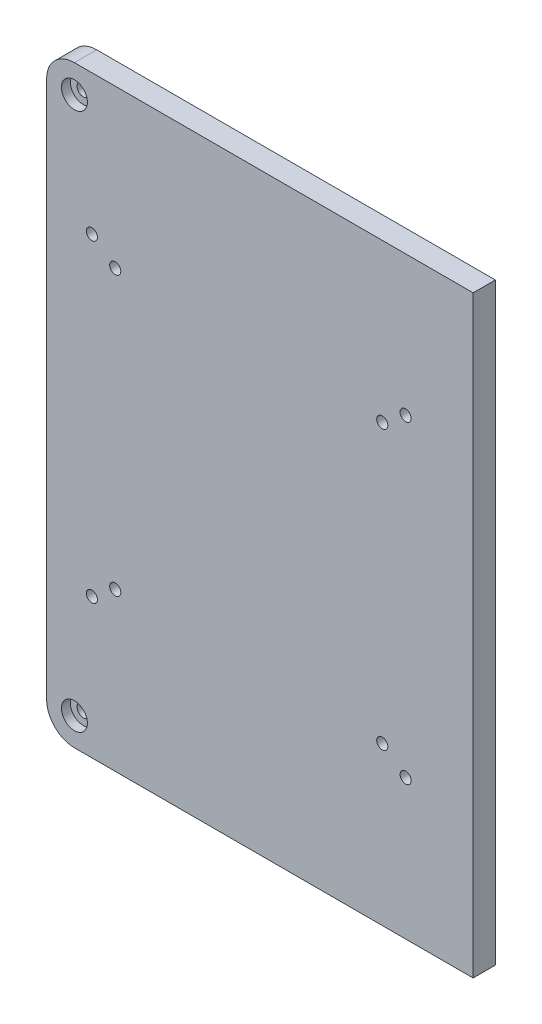
ISO-10303-21;
HEADER;
FILE_DESCRIPTION(('STEP AP214'),'2;1');
FILE_NAME('part.step','',(''),(''),'','','');
FILE_SCHEMA(('AUTOMOTIVE_DESIGN { 1 0 10303 214 1 1 1 1 }'));
ENDSEC;
DATA;
#1=APPLICATION_CONTEXT('core data for automotive mechanical design processes');
#2=APPLICATION_PROTOCOL_DEFINITION('international standard','automotive_design',2000,#1);
#3=PRODUCT_CONTEXT('',#1,'mechanical');
#4=PRODUCT('Part','Part','',(#3));
#5=PRODUCT_RELATED_PRODUCT_CATEGORY('part','',(#4));
#6=PRODUCT_DEFINITION_FORMATION('','',#4);
#7=PRODUCT_DEFINITION_CONTEXT('part definition',#1,'design');
#8=PRODUCT_DEFINITION('design','',#6,#7);
#9=PRODUCT_DEFINITION_SHAPE('','',#8);
#10=(LENGTH_UNIT() NAMED_UNIT(*) SI_UNIT(.MILLI.,.METRE.));
#11=(NAMED_UNIT(*) PLANE_ANGLE_UNIT() SI_UNIT($,.RADIAN.));
#12=(NAMED_UNIT(*) SI_UNIT($,.STERADIAN.) SOLID_ANGLE_UNIT());
#13=UNCERTAINTY_MEASURE_WITH_UNIT(LENGTH_MEASURE(1.E-05),#10,'distance_accuracy_value','');
#14=(GEOMETRIC_REPRESENTATION_CONTEXT(3) GLOBAL_UNCERTAINTY_ASSIGNED_CONTEXT((#13)) GLOBAL_UNIT_ASSIGNED_CONTEXT((#10,
#11,#12)) REPRESENTATION_CONTEXT('',''));
#15=CARTESIAN_POINT('',(0.,0.,0.));
#16=DIRECTION('',(0.,0.,1.));
#17=DIRECTION('',(1.,0.,0.));
#18=AXIS2_PLACEMENT_3D('',#15,#16,#17);
#19=CARTESIAN_POINT('',(-102.8,42.3,0.));
#20=DIRECTION('',(0.,0.,1.));
#21=DIRECTION('',(1.,0.,0.));
#22=AXIS2_PLACEMENT_3D('',#19,#20,#21);
#23=CYLINDRICAL_SURFACE('',#22,1.5);
#24=CARTESIAN_POINT('',(-102.8,42.3,6.));
#25=DIRECTION('',(0.,0.,1.));
#26=DIRECTION('',(1.,0.,0.));
#27=AXIS2_PLACEMENT_3D('',#24,#25,#26);
#28=CIRCLE('',#27,1.5);
#29=CARTESIAN_POINT('',(-101.3,42.3,6.));
#30=VERTEX_POINT('',#29);
#31=EDGE_CURVE('E154',#30,#30,#28,.T.);
#32=ORIENTED_EDGE('',*,*,#31,.T.);
#33=EDGE_LOOP('',(#32));
#34=FACE_BOUND('',#33,.T.);
#35=CARTESIAN_POINT('',(-102.8,42.3,3.5));
#36=DIRECTION('',(0.,0.,-1.));
#37=DIRECTION('',(-1.,0.,0.));
#38=AXIS2_PLACEMENT_3D('',#35,#36,#37);
#39=CIRCLE('',#38,1.5);
#40=CARTESIAN_POINT('',(-104.3,42.3,3.5));
#41=VERTEX_POINT('',#40);
#42=EDGE_CURVE('E36',#41,#41,#39,.F.);
#43=ORIENTED_EDGE('',*,*,#42,.F.);
#44=EDGE_LOOP('',(#43));
#45=FACE_BOUND('',#44,.T.);
#46=ADVANCED_FACE('F32',(#34,#45),#23,.F.);
#47=CARTESIAN_POINT('',(-18.2,-42.3,0.));
#48=DIRECTION('',(0.,0.,1.));
#49=DIRECTION('',(1.,0.,0.));
#50=AXIS2_PLACEMENT_3D('',#47,#48,#49);
#51=CYLINDRICAL_SURFACE('',#50,1.5);
#52=CARTESIAN_POINT('',(-18.2,-42.3,6.));
#53=DIRECTION('',(0.,0.,1.));
#54=DIRECTION('',(1.,0.,0.));
#55=AXIS2_PLACEMENT_3D('',#52,#53,#54);
#56=CIRCLE('',#55,1.5);
#57=CARTESIAN_POINT('',(-16.7,-42.3,6.));
#58=VERTEX_POINT('',#57);
#59=EDGE_CURVE('E155',#58,#58,#56,.T.);
#60=ORIENTED_EDGE('',*,*,#59,.T.);
#61=EDGE_LOOP('',(#60));
#62=FACE_BOUND('',#61,.T.);
#63=CARTESIAN_POINT('',(-18.2,-42.3,3.5));
#64=DIRECTION('',(0.,0.,-1.));
#65=DIRECTION('',(-1.,0.,0.));
#66=AXIS2_PLACEMENT_3D('',#63,#64,#65);
#67=CIRCLE('',#66,1.5);
#68=CARTESIAN_POINT('',(-19.7,-42.3,3.5));
#69=VERTEX_POINT('',#68);
#70=EDGE_CURVE('E134',#69,#69,#67,.F.);
#71=ORIENTED_EDGE('',*,*,#70,.F.);
#72=EDGE_LOOP('',(#71));
#73=FACE_BOUND('',#72,.T.);
#74=ADVANCED_FACE('F207',(#62,#73),#51,.F.);
#75=CARTESIAN_POINT('',(-102.8,-42.3,0.));
#76=DIRECTION('',(0.,0.,1.));
#77=DIRECTION('',(1.,0.,0.));
#78=AXIS2_PLACEMENT_3D('',#75,#76,#77);
#79=CYLINDRICAL_SURFACE('',#78,1.5);
#80=CARTESIAN_POINT('',(-102.8,-42.3,6.));
#81=DIRECTION('',(0.,0.,1.));
#82=DIRECTION('',(1.,0.,0.));
#83=AXIS2_PLACEMENT_3D('',#80,#81,#82);
#84=CIRCLE('',#83,1.5);
#85=CARTESIAN_POINT('',(-101.3,-42.3,6.));
#86=VERTEX_POINT('',#85);
#87=EDGE_CURVE('E151',#86,#86,#84,.T.);
#88=ORIENTED_EDGE('',*,*,#87,.T.);
#89=EDGE_LOOP('',(#88));
#90=FACE_BOUND('',#89,.T.);
#91=CARTESIAN_POINT('',(-102.8,-42.3,3.5));
#92=DIRECTION('',(0.,0.,-1.));
#93=DIRECTION('',(-1.,0.,0.));
#94=AXIS2_PLACEMENT_3D('',#91,#92,#93);
#95=CIRCLE('',#94,1.5);
#96=CARTESIAN_POINT('',(-104.3,-42.3,3.5));
#97=VERTEX_POINT('',#96);
#98=EDGE_CURVE('E132',#97,#97,#95,.F.);
#99=ORIENTED_EDGE('',*,*,#98,.F.);
#100=EDGE_LOOP('',(#99));
#101=FACE_BOUND('',#100,.T.);
#102=ADVANCED_FACE('F213',(#90,#101),#79,.F.);
#103=CARTESIAN_POINT('',(-18.2,42.3,0.));
#104=DIRECTION('',(0.,0.,1.));
#105=DIRECTION('',(1.,0.,0.));
#106=AXIS2_PLACEMENT_3D('',#103,#104,#105);
#107=CYLINDRICAL_SURFACE('',#106,1.5);
#108=CARTESIAN_POINT('',(-18.2,42.3,6.));
#109=DIRECTION('',(0.,0.,1.));
#110=DIRECTION('',(1.,0.,0.));
#111=AXIS2_PLACEMENT_3D('',#108,#109,#110);
#112=CIRCLE('',#111,1.5);
#113=CARTESIAN_POINT('',(-16.7,42.3,6.));
#114=VERTEX_POINT('',#113);
#115=EDGE_CURVE('E130',#114,#114,#112,.T.);
#116=ORIENTED_EDGE('',*,*,#115,.T.);
#117=EDGE_LOOP('',(#116));
#118=FACE_BOUND('',#117,.T.);
#119=CARTESIAN_POINT('',(-18.2,42.3,3.5));
#120=DIRECTION('',(0.,0.,-1.));
#121=DIRECTION('',(-1.,0.,0.));
#122=AXIS2_PLACEMENT_3D('',#119,#120,#121);
#123=CIRCLE('',#122,1.5);
#124=CARTESIAN_POINT('',(-19.7,42.3,3.5));
#125=VERTEX_POINT('',#124);
#126=EDGE_CURVE('E127',#125,#125,#123,.F.);
#127=ORIENTED_EDGE('',*,*,#126,.F.);
#128=EDGE_LOOP('',(#127));
#129=FACE_BOUND('',#128,.T.);
#130=ADVANCED_FACE('F205',(#118,#129),#107,.F.);
#131=CARTESIAN_POINT('',(-107.5,-72.5,6.));
#132=DIRECTION('',(0.,0.,-1.));
#133=DIRECTION('',(-1.,0.,0.));
#134=AXIS2_PLACEMENT_3D('',#131,#132,#133);
#135=CYLINDRICAL_SURFACE('',#134,7.5);
#136=CARTESIAN_POINT('',(-107.5,-72.5,0.));
#137=DIRECTION('',(0.,0.,1.));
#138=DIRECTION('',(1.,0.,0.));
#139=AXIS2_PLACEMENT_3D('',#136,#137,#138);
#140=CIRCLE('',#139,7.5);
#141=CARTESIAN_POINT('',(-115.,-72.5,0.));
#142=VERTEX_POINT('',#141);
#143=CARTESIAN_POINT('',(-107.5,-80.,0.));
#144=VERTEX_POINT('',#143);
#145=EDGE_CURVE('E116',#142,#144,#140,.T.);
#146=ORIENTED_EDGE('',*,*,#145,.T.);
#147=DIRECTION('',(0.,0.,-1.));
#148=VECTOR('',#147,1.);
#149=CARTESIAN_POINT('',(-107.5,-80.,6.));
#150=LINE('',#149,#148);
#151=CARTESIAN_POINT('',(-107.5,-80.,6.));
#152=VERTEX_POINT('',#151);
#153=EDGE_CURVE('E11',#152,#144,#150,.T.);
#154=ORIENTED_EDGE('',*,*,#153,.F.);
#155=CARTESIAN_POINT('',(-107.5,-72.5,6.));
#156=DIRECTION('',(0.,0.,1.));
#157=DIRECTION('',(1.,0.,0.));
#158=AXIS2_PLACEMENT_3D('',#155,#156,#157);
#159=CIRCLE('',#158,7.5);
#160=CARTESIAN_POINT('',(-115.,-72.5,6.));
#161=VERTEX_POINT('',#160);
#162=EDGE_CURVE('E121',#161,#152,#159,.T.);
#163=ORIENTED_EDGE('',*,*,#162,.F.);
#164=DIRECTION('',(0.,0.,-1.));
#165=VECTOR('',#164,1.);
#166=CARTESIAN_POINT('',(-115.,-72.5,6.));
#167=LINE('',#166,#165);
#168=EDGE_CURVE('E122',#161,#142,#167,.T.);
#169=ORIENTED_EDGE('',*,*,#168,.T.);
#170=EDGE_LOOP('',(#146,#154,#163,#169));
#171=FACE_BOUND('',#170,.T.);
#172=ADVANCED_FACE('F34',(#171),#135,.T.);
#173=CARTESIAN_POINT('',(-107.5,-80.,6.));
#174=DIRECTION('',(0.,1.,0.));
#175=DIRECTION('',(0.,0.,1.));
#176=AXIS2_PLACEMENT_3D('',#173,#174,#175);
#177=PLANE('',#176);
#178=DIRECTION('',(1.,0.,0.));
#179=VECTOR('',#178,1.);
#180=CARTESIAN_POINT('',(-107.5,-80.,0.));
#181=LINE('',#180,#179);
#182=CARTESIAN_POINT('',(0.,-80.,0.));
#183=VERTEX_POINT('',#182);
#184=EDGE_CURVE('E113',#144,#183,#181,.T.);
#185=ORIENTED_EDGE('',*,*,#184,.T.);
#186=DIRECTION('',(0.,0.,-1.));
#187=VECTOR('',#186,1.);
#188=CARTESIAN_POINT('',(0.,-80.,10.));
#189=LINE('',#188,#187);
#190=CARTESIAN_POINT('',(0.,-80.,6.));
#191=VERTEX_POINT('',#190);
#192=EDGE_CURVE('E49',#191,#183,#189,.T.);
#193=ORIENTED_EDGE('',*,*,#192,.F.);
#194=DIRECTION('',(1.,0.,0.));
#195=VECTOR('',#194,1.);
#196=CARTESIAN_POINT('',(-107.5,-80.,6.));
#197=LINE('',#196,#195);
#198=EDGE_CURVE('E85',#152,#191,#197,.T.);
#199=ORIENTED_EDGE('',*,*,#198,.F.);
#200=ORIENTED_EDGE('',*,*,#153,.T.);
#201=EDGE_LOOP('',(#185,#193,#199,#200));
#202=FACE_BOUND('',#201,.T.);
#203=ADVANCED_FACE('F196',(#202),#177,.F.);
#204=CARTESIAN_POINT('',(-107.5,80.,6.));
#205=DIRECTION('',(0.,-1.,0.));
#206=DIRECTION('',(0.,0.,-1.));
#207=AXIS2_PLACEMENT_3D('',#204,#205,#206);
#208=PLANE('',#207);
#209=DIRECTION('',(-1.,0.,0.));
#210=VECTOR('',#209,1.);
#211=CARTESIAN_POINT('',(-107.5,80.,6.));
#212=LINE('',#211,#210);
#213=CARTESIAN_POINT('',(0.,80.,6.));
#214=VERTEX_POINT('',#213);
#215=CARTESIAN_POINT('',(-107.5,80.,6.));
#216=VERTEX_POINT('',#215);
#217=EDGE_CURVE('E108',#214,#216,#212,.T.);
#218=ORIENTED_EDGE('',*,*,#217,.F.);
#219=DIRECTION('',(0.,0.,-1.));
#220=VECTOR('',#219,1.);
#221=CARTESIAN_POINT('',(0.,80.,10.));
#222=LINE('',#221,#220);
#223=CARTESIAN_POINT('',(0.,80.,0.));
#224=VERTEX_POINT('',#223);
#225=EDGE_CURVE('E96',#214,#224,#222,.T.);
#226=ORIENTED_EDGE('',*,*,#225,.T.);
#227=DIRECTION('',(-1.,0.,0.));
#228=VECTOR('',#227,1.);
#229=CARTESIAN_POINT('',(-107.5,80.,0.));
#230=LINE('',#229,#228);
#231=CARTESIAN_POINT('',(-107.5,80.,0.));
#232=VERTEX_POINT('',#231);
#233=EDGE_CURVE('E106',#224,#232,#230,.T.);
#234=ORIENTED_EDGE('',*,*,#233,.T.);
#235=DIRECTION('',(0.,0.,-1.));
#236=VECTOR('',#235,1.);
#237=CARTESIAN_POINT('',(-107.5,80.,6.));
#238=LINE('',#237,#236);
#239=EDGE_CURVE('E41',#216,#232,#238,.T.);
#240=ORIENTED_EDGE('',*,*,#239,.F.);
#241=EDGE_LOOP('',(#218,#226,#234,#240));
#242=FACE_BOUND('',#241,.T.);
#243=ADVANCED_FACE('F104',(#242),#208,.F.);
#244=CARTESIAN_POINT('',(-107.5,72.5,6.));
#245=DIRECTION('',(0.,0.,-1.));
#246=DIRECTION('',(-1.,0.,0.));
#247=AXIS2_PLACEMENT_3D('',#244,#245,#246);
#248=CYLINDRICAL_SURFACE('',#247,7.49999999999999);
#249=CARTESIAN_POINT('',(-107.5,72.5,0.));
#250=DIRECTION('',(0.,0.,1.));
#251=DIRECTION('',(1.,0.,0.));
#252=AXIS2_PLACEMENT_3D('',#249,#250,#251);
#253=CIRCLE('',#252,7.49999999999999);
#254=CARTESIAN_POINT('',(-115.,72.5,0.));
#255=VERTEX_POINT('',#254);
#256=EDGE_CURVE('E112',#232,#255,#253,.T.);
#257=ORIENTED_EDGE('',*,*,#256,.T.);
#258=DIRECTION('',(0.,0.,-1.));
#259=VECTOR('',#258,1.);
#260=CARTESIAN_POINT('',(-115.,72.5,6.));
#261=LINE('',#260,#259);
#262=CARTESIAN_POINT('',(-115.,72.5,6.));
#263=VERTEX_POINT('',#262);
#264=EDGE_CURVE('E124',#263,#255,#261,.T.);
#265=ORIENTED_EDGE('',*,*,#264,.F.);
#266=CARTESIAN_POINT('',(-107.5,72.5,6.));
#267=DIRECTION('',(0.,0.,1.));
#268=DIRECTION('',(1.,0.,0.));
#269=AXIS2_PLACEMENT_3D('',#266,#267,#268);
#270=CIRCLE('',#269,7.49999999999999);
#271=EDGE_CURVE('E189',#216,#263,#270,.T.);
#272=ORIENTED_EDGE('',*,*,#271,.F.);
#273=ORIENTED_EDGE('',*,*,#239,.T.);
#274=EDGE_LOOP('',(#257,#265,#272,#273));
#275=FACE_BOUND('',#274,.T.);
#276=ADVANCED_FACE('F202',(#275),#248,.T.);
#277=CARTESIAN_POINT('',(-115.,72.5,6.));
#278=DIRECTION('',(1.,0.,0.));
#279=DIRECTION('',(0.,0.,-1.));
#280=AXIS2_PLACEMENT_3D('',#277,#278,#279);
#281=PLANE('',#280);
#282=DIRECTION('',(0.,-1.,0.));
#283=VECTOR('',#282,1.);
#284=CARTESIAN_POINT('',(-115.,72.5,0.));
#285=LINE('',#284,#283);
#286=EDGE_CURVE('E79',#255,#142,#285,.T.);
#287=ORIENTED_EDGE('',*,*,#286,.T.);
#288=ORIENTED_EDGE('',*,*,#168,.F.);
#289=DIRECTION('',(0.,-1.,0.));
#290=VECTOR('',#289,1.);
#291=CARTESIAN_POINT('',(-115.,72.5,6.));
#292=LINE('',#291,#290);
#293=EDGE_CURVE('E58',#263,#161,#292,.T.);
#294=ORIENTED_EDGE('',*,*,#293,.F.);
#295=ORIENTED_EDGE('',*,*,#264,.T.);
#296=EDGE_LOOP('',(#287,#288,#294,#295));
#297=FACE_BOUND('',#296,.T.);
#298=ADVANCED_FACE('F239',(#297),#281,.F.);
#299=CARTESIAN_POINT('',(-107.5,-72.5,6.));
#300=DIRECTION('',(0.,0.,1.));
#301=DIRECTION('',(1.,0.,0.));
#302=AXIS2_PLACEMENT_3D('',#299,#300,#301);
#303=PLANE('',#302);
#304=DIRECTION('',(0.,-1.,0.));
#305=VECTOR('',#304,1.);
#306=CARTESIAN_POINT('',(0.,-72.5,6.));
#307=LINE('',#306,#305);
#308=EDGE_CURVE('E253',#214,#191,#307,.T.);
#309=ORIENTED_EDGE('',*,*,#308,.F.);
#310=ORIENTED_EDGE('',*,*,#217,.T.);
#311=ORIENTED_EDGE('',*,*,#271,.T.);
#312=ORIENTED_EDGE('',*,*,#293,.T.);
#313=ORIENTED_EDGE('',*,*,#162,.T.);
#314=ORIENTED_EDGE('',*,*,#198,.T.);
#315=EDGE_LOOP('',(#309,#310,#311,#312,#313,#314));
#316=FACE_BOUND('',#315,.T.);
#317=CARTESIAN_POINT('',(-107.5,72.5,6.));
#318=DIRECTION('',(0.,0.,1.));
#319=DIRECTION('',(1.,0.,0.));
#320=AXIS2_PLACEMENT_3D('',#317,#318,#319);
#321=CIRCLE('',#320,3.5);
#322=CARTESIAN_POINT('',(-104.,72.5,6.));
#323=VERTEX_POINT('',#322);
#324=EDGE_CURVE('E254',#323,#323,#321,.T.);
#325=ORIENTED_EDGE('',*,*,#324,.F.);
#326=EDGE_LOOP('',(#325));
#327=FACE_BOUND('',#326,.T.);
#328=CARTESIAN_POINT('',(-107.5,-72.5,6.));
#329=DIRECTION('',(0.,0.,1.));
#330=DIRECTION('',(1.,0.,0.));
#331=AXIS2_PLACEMENT_3D('',#328,#329,#330);
#332=CIRCLE('',#331,3.5);
#333=CARTESIAN_POINT('',(-104.,-72.5,6.));
#334=VERTEX_POINT('',#333);
#335=EDGE_CURVE('E269',#334,#334,#332,.T.);
#336=ORIENTED_EDGE('',*,*,#335,.F.);
#337=EDGE_LOOP('',(#336));
#338=FACE_BOUND('',#337,.T.);
#339=ORIENTED_EDGE('',*,*,#87,.F.);
#340=EDGE_LOOP('',(#339));
#341=FACE_BOUND('',#340,.T.);
#342=ORIENTED_EDGE('',*,*,#59,.F.);
#343=EDGE_LOOP('',(#342));
#344=FACE_BOUND('',#343,.T.);
#345=ORIENTED_EDGE('',*,*,#115,.F.);
#346=EDGE_LOOP('',(#345));
#347=FACE_BOUND('',#346,.T.);
#348=ORIENTED_EDGE('',*,*,#31,.F.);
#349=EDGE_LOOP('',(#348));
#350=FACE_BOUND('',#349,.T.);
#351=CARTESIAN_POINT('',(-96.5,-37.5,6.));
#352=DIRECTION('',(0.,0.,1.));
#353=DIRECTION('',(1.,0.,0.));
#354=AXIS2_PLACEMENT_3D('',#351,#352,#353);
#355=CIRCLE('',#354,1.5);
#356=CARTESIAN_POINT('',(-95.,-37.5,6.));
#357=VERTEX_POINT('',#356);
#358=EDGE_CURVE('E167',#357,#357,#355,.T.);
#359=ORIENTED_EDGE('',*,*,#358,.F.);
#360=EDGE_LOOP('',(#359));
#361=FACE_BOUND('',#360,.T.);
#362=CARTESIAN_POINT('',(-24.5,37.5,6.));
#363=DIRECTION('',(0.,0.,1.));
#364=DIRECTION('',(1.,0.,0.));
#365=AXIS2_PLACEMENT_3D('',#362,#363,#364);
#366=CIRCLE('',#365,1.5);
#367=CARTESIAN_POINT('',(-23.,37.5,6.));
#368=VERTEX_POINT('',#367);
#369=EDGE_CURVE('E173',#368,#368,#366,.T.);
#370=ORIENTED_EDGE('',*,*,#369,.F.);
#371=EDGE_LOOP('',(#370));
#372=FACE_BOUND('',#371,.T.);
#373=CARTESIAN_POINT('',(-24.5,-37.5,6.));
#374=DIRECTION('',(0.,0.,1.));
#375=DIRECTION('',(1.,0.,0.));
#376=AXIS2_PLACEMENT_3D('',#373,#374,#375);
#377=CIRCLE('',#376,1.5);
#378=CARTESIAN_POINT('',(-23.,-37.5,6.));
#379=VERTEX_POINT('',#378);
#380=EDGE_CURVE('E162',#379,#379,#377,.T.);
#381=ORIENTED_EDGE('',*,*,#380,.F.);
#382=EDGE_LOOP('',(#381));
#383=FACE_BOUND('',#382,.T.);
#384=CARTESIAN_POINT('',(-96.5,37.5,6.));
#385=DIRECTION('',(0.,0.,1.));
#386=DIRECTION('',(1.,0.,0.));
#387=AXIS2_PLACEMENT_3D('',#384,#385,#386);
#388=CIRCLE('',#387,1.5);
#389=CARTESIAN_POINT('',(-95.,37.5,6.));
#390=VERTEX_POINT('',#389);
#391=EDGE_CURVE('E166',#390,#390,#388,.T.);
#392=ORIENTED_EDGE('',*,*,#391,.F.);
#393=EDGE_LOOP('',(#392));
#394=FACE_BOUND('',#393,.T.);
#395=ADVANCED_FACE('F236',(#316,#327,#338,#341,#344,#347,#350,#361,#372,#383,#394),#303,.T.);
#396=CARTESIAN_POINT('',(-107.5,-72.5,0.));
#397=DIRECTION('',(0.,0.,1.));
#398=DIRECTION('',(1.,0.,0.));
#399=AXIS2_PLACEMENT_3D('',#396,#397,#398);
#400=PLANE('',#399);
#401=CARTESIAN_POINT('',(-107.5,72.5,0.));
#402=DIRECTION('',(0.,0.,1.));
#403=DIRECTION('',(1.,0.,0.));
#404=AXIS2_PLACEMENT_3D('',#401,#402,#403);
#405=CIRCLE('',#404,1.69999999999999);
#406=CARTESIAN_POINT('',(-105.8,72.5,0.));
#407=VERTEX_POINT('',#406);
#408=EDGE_CURVE('E266',#407,#407,#405,.T.);
#409=ORIENTED_EDGE('',*,*,#408,.T.);
#410=EDGE_LOOP('',(#409));
#411=FACE_BOUND('',#410,.T.);
#412=CARTESIAN_POINT('',(-107.5,-72.5,0.));
#413=DIRECTION('',(0.,0.,1.));
#414=DIRECTION('',(1.,0.,0.));
#415=AXIS2_PLACEMENT_3D('',#412,#413,#414);
#416=CIRCLE('',#415,1.69999999999999);
#417=CARTESIAN_POINT('',(-105.8,-72.5,0.));
#418=VERTEX_POINT('',#417);
#419=EDGE_CURVE('E278',#418,#418,#416,.T.);
#420=ORIENTED_EDGE('',*,*,#419,.T.);
#421=EDGE_LOOP('',(#420));
#422=FACE_BOUND('',#421,.T.);
#423=CARTESIAN_POINT('',(-18.2,-42.3,0.));
#424=DIRECTION('',(0.,0.,-1.));
#425=DIRECTION('',(-1.,0.,0.));
#426=AXIS2_PLACEMENT_3D('',#423,#424,#425);
#427=CIRCLE('',#426,3.);
#428=CARTESIAN_POINT('',(-21.2,-42.3,0.));
#429=VERTEX_POINT('',#428);
#430=EDGE_CURVE('E284',#429,#429,#427,.T.);
#431=ORIENTED_EDGE('',*,*,#430,.F.);
#432=EDGE_LOOP('',(#431));
#433=FACE_BOUND('',#432,.T.);
#434=CARTESIAN_POINT('',(-102.8,-42.3,0.));
#435=DIRECTION('',(0.,0.,-1.));
#436=DIRECTION('',(-1.,0.,0.));
#437=AXIS2_PLACEMENT_3D('',#434,#435,#436);
#438=CIRCLE('',#437,3.00000000000001);
#439=CARTESIAN_POINT('',(-105.8,-42.3,0.));
#440=VERTEX_POINT('',#439);
#441=EDGE_CURVE('E290',#440,#440,#438,.T.);
#442=ORIENTED_EDGE('',*,*,#441,.F.);
#443=EDGE_LOOP('',(#442));
#444=FACE_BOUND('',#443,.T.);
#445=CARTESIAN_POINT('',(-102.8,42.3,0.));
#446=DIRECTION('',(0.,0.,-1.));
#447=DIRECTION('',(-1.,0.,0.));
#448=AXIS2_PLACEMENT_3D('',#445,#446,#447);
#449=CIRCLE('',#448,3.00000000000001);
#450=CARTESIAN_POINT('',(-105.8,42.3,0.));
#451=VERTEX_POINT('',#450);
#452=EDGE_CURVE('E281',#451,#451,#449,.T.);
#453=ORIENTED_EDGE('',*,*,#452,.F.);
#454=EDGE_LOOP('',(#453));
#455=FACE_BOUND('',#454,.T.);
#456=CARTESIAN_POINT('',(-18.2,42.3,0.));
#457=DIRECTION('',(0.,0.,-1.));
#458=DIRECTION('',(-1.,0.,0.));
#459=AXIS2_PLACEMENT_3D('',#456,#457,#458);
#460=CIRCLE('',#459,3.);
#461=CARTESIAN_POINT('',(-21.2,42.3,0.));
#462=VERTEX_POINT('',#461);
#463=EDGE_CURVE('E140',#462,#462,#460,.T.);
#464=ORIENTED_EDGE('',*,*,#463,.F.);
#465=EDGE_LOOP('',(#464));
#466=FACE_BOUND('',#465,.T.);
#467=CARTESIAN_POINT('',(-96.5,-37.5,0.));
#468=DIRECTION('',(0.,0.,1.));
#469=DIRECTION('',(1.,0.,0.));
#470=AXIS2_PLACEMENT_3D('',#467,#468,#469);
#471=CIRCLE('',#470,1.5);
#472=CARTESIAN_POINT('',(-95.,-37.5,0.));
#473=VERTEX_POINT('',#472);
#474=EDGE_CURVE('E163',#473,#473,#471,.T.);
#475=ORIENTED_EDGE('',*,*,#474,.T.);
#476=EDGE_LOOP('',(#475));
#477=FACE_BOUND('',#476,.T.);
#478=CARTESIAN_POINT('',(-24.5,37.5,0.));
#479=DIRECTION('',(0.,0.,1.));
#480=DIRECTION('',(1.,0.,0.));
#481=AXIS2_PLACEMENT_3D('',#478,#479,#480);
#482=CIRCLE('',#481,1.5);
#483=CARTESIAN_POINT('',(-23.,37.5,0.));
#484=VERTEX_POINT('',#483);
#485=EDGE_CURVE('E170',#484,#484,#482,.T.);
#486=ORIENTED_EDGE('',*,*,#485,.T.);
#487=EDGE_LOOP('',(#486));
#488=FACE_BOUND('',#487,.T.);
#489=CARTESIAN_POINT('',(-24.5,-37.5,0.));
#490=DIRECTION('',(0.,0.,1.));
#491=DIRECTION('',(1.,0.,0.));
#492=AXIS2_PLACEMENT_3D('',#489,#490,#491);
#493=CIRCLE('',#492,1.5);
#494=CARTESIAN_POINT('',(-23.,-37.5,0.));
#495=VERTEX_POINT('',#494);
#496=EDGE_CURVE('E176',#495,#495,#493,.T.);
#497=ORIENTED_EDGE('',*,*,#496,.T.);
#498=EDGE_LOOP('',(#497));
#499=FACE_BOUND('',#498,.T.);
#500=CARTESIAN_POINT('',(-96.5,37.5,0.));
#501=DIRECTION('',(0.,0.,1.));
#502=DIRECTION('',(1.,0.,0.));
#503=AXIS2_PLACEMENT_3D('',#500,#501,#502);
#504=CIRCLE('',#503,1.5);
#505=CARTESIAN_POINT('',(-95.,37.5,0.));
#506=VERTEX_POINT('',#505);
#507=EDGE_CURVE('E181',#506,#506,#504,.T.);
#508=ORIENTED_EDGE('',*,*,#507,.T.);
#509=EDGE_LOOP('',(#508));
#510=FACE_BOUND('',#509,.T.);
#511=ORIENTED_EDGE('',*,*,#233,.F.);
#512=DIRECTION('',(0.,1.,0.));
#513=VECTOR('',#512,1.);
#514=CARTESIAN_POINT('',(0.,80.,0.));
#515=LINE('',#514,#513);
#516=EDGE_CURVE('E93',#183,#224,#515,.T.);
#517=ORIENTED_EDGE('',*,*,#516,.F.);
#518=ORIENTED_EDGE('',*,*,#184,.F.);
#519=ORIENTED_EDGE('',*,*,#145,.F.);
#520=ORIENTED_EDGE('',*,*,#286,.F.);
#521=ORIENTED_EDGE('',*,*,#256,.F.);
#522=EDGE_LOOP('',(#511,#517,#518,#519,#520,#521));
#523=FACE_BOUND('',#522,.T.);
#524=ADVANCED_FACE('F111',(#411,#422,#433,#444,#455,#466,#477,#488,#499,#510,#523),#400,.F.);
#525=CARTESIAN_POINT('',(-96.5,37.5,0.));
#526=DIRECTION('',(0.,0.,1.));
#527=DIRECTION('',(1.,0.,0.));
#528=AXIS2_PLACEMENT_3D('',#525,#526,#527);
#529=CYLINDRICAL_SURFACE('',#528,1.5);
#530=ORIENTED_EDGE('',*,*,#507,.F.);
#531=EDGE_LOOP('',(#530));
#532=FACE_BOUND('',#531,.T.);
#533=ORIENTED_EDGE('',*,*,#391,.T.);
#534=EDGE_LOOP('',(#533));
#535=FACE_BOUND('',#534,.T.);
#536=ADVANCED_FACE('F231',(#532,#535),#529,.F.);
#537=CARTESIAN_POINT('',(-24.5,-37.5,0.));
#538=DIRECTION('',(0.,0.,1.));
#539=DIRECTION('',(1.,0.,0.));
#540=AXIS2_PLACEMENT_3D('',#537,#538,#539);
#541=CYLINDRICAL_SURFACE('',#540,1.5);
#542=ORIENTED_EDGE('',*,*,#496,.F.);
#543=EDGE_LOOP('',(#542));
#544=FACE_BOUND('',#543,.T.);
#545=ORIENTED_EDGE('',*,*,#380,.T.);
#546=EDGE_LOOP('',(#545));
#547=FACE_BOUND('',#546,.T.);
#548=ADVANCED_FACE('F227',(#544,#547),#541,.F.);
#549=CARTESIAN_POINT('',(-24.5,37.5,0.));
#550=DIRECTION('',(0.,0.,1.));
#551=DIRECTION('',(1.,0.,0.));
#552=AXIS2_PLACEMENT_3D('',#549,#550,#551);
#553=CYLINDRICAL_SURFACE('',#552,1.5);
#554=ORIENTED_EDGE('',*,*,#485,.F.);
#555=EDGE_LOOP('',(#554));
#556=FACE_BOUND('',#555,.T.);
#557=ORIENTED_EDGE('',*,*,#369,.T.);
#558=EDGE_LOOP('',(#557));
#559=FACE_BOUND('',#558,.T.);
#560=ADVANCED_FACE('F223',(#556,#559),#553,.F.);
#561=CARTESIAN_POINT('',(-96.5,-37.5,0.));
#562=DIRECTION('',(0.,0.,1.));
#563=DIRECTION('',(1.,0.,0.));
#564=AXIS2_PLACEMENT_3D('',#561,#562,#563);
#565=CYLINDRICAL_SURFACE('',#564,1.5);
#566=ORIENTED_EDGE('',*,*,#474,.F.);
#567=EDGE_LOOP('',(#566));
#568=FACE_BOUND('',#567,.T.);
#569=ORIENTED_EDGE('',*,*,#358,.T.);
#570=EDGE_LOOP('',(#569));
#571=FACE_BOUND('',#570,.T.);
#572=ADVANCED_FACE('F219',(#568,#571),#565,.F.);
#573=CARTESIAN_POINT('',(-18.2,42.3,3.5));
#574=DIRECTION('',(0.,0.,-1.));
#575=DIRECTION('',(-1.,0.,0.));
#576=AXIS2_PLACEMENT_3D('',#573,#574,#575);
#577=PLANE('',#576);
#578=CARTESIAN_POINT('',(-18.2,42.3,3.5));
#579=DIRECTION('',(0.,0.,-1.));
#580=DIRECTION('',(-1.,0.,0.));
#581=AXIS2_PLACEMENT_3D('',#578,#579,#580);
#582=CIRCLE('',#581,3.);
#583=CARTESIAN_POINT('',(-21.2,42.3,3.5));
#584=VERTEX_POINT('',#583);
#585=EDGE_CURVE('E131',#584,#584,#582,.T.);
#586=ORIENTED_EDGE('',*,*,#585,.T.);
#587=EDGE_LOOP('',(#586));
#588=FACE_BOUND('',#587,.T.);
#589=ORIENTED_EDGE('',*,*,#126,.T.);
#590=EDGE_LOOP('',(#589));
#591=FACE_BOUND('',#590,.T.);
#592=ADVANCED_FACE('F222',(#588,#591),#577,.T.);
#593=CARTESIAN_POINT('',(-18.2,42.3,3.5));
#594=DIRECTION('',(0.,0.,-1.));
#595=DIRECTION('',(-1.,0.,0.));
#596=AXIS2_PLACEMENT_3D('',#593,#594,#595);
#597=CYLINDRICAL_SURFACE('',#596,3.);
#598=ORIENTED_EDGE('',*,*,#585,.F.);
#599=EDGE_LOOP('',(#598));
#600=FACE_BOUND('',#599,.T.);
#601=ORIENTED_EDGE('',*,*,#463,.T.);
#602=EDGE_LOOP('',(#601));
#603=FACE_BOUND('',#602,.T.);
#604=ADVANCED_FACE('F341',(#600,#603),#597,.F.);
#605=CARTESIAN_POINT('',(-102.8,-42.3,3.5));
#606=DIRECTION('',(0.,0.,-1.));
#607=DIRECTION('',(-1.,0.,0.));
#608=AXIS2_PLACEMENT_3D('',#605,#606,#607);
#609=PLANE('',#608);
#610=CARTESIAN_POINT('',(-102.8,-42.3,3.5));
#611=DIRECTION('',(0.,0.,-1.));
#612=DIRECTION('',(-1.,0.,0.));
#613=AXIS2_PLACEMENT_3D('',#610,#611,#612);
#614=CIRCLE('',#613,3.00000000000001);
#615=CARTESIAN_POINT('',(-105.8,-42.3,3.5));
#616=VERTEX_POINT('',#615);
#617=EDGE_CURVE('E287',#616,#616,#614,.T.);
#618=ORIENTED_EDGE('',*,*,#617,.T.);
#619=EDGE_LOOP('',(#618));
#620=FACE_BOUND('',#619,.T.);
#621=ORIENTED_EDGE('',*,*,#98,.T.);
#622=EDGE_LOOP('',(#621));
#623=FACE_BOUND('',#622,.T.);
#624=ADVANCED_FACE('F345',(#620,#623),#609,.T.);
#625=CARTESIAN_POINT('',(-102.8,-42.3,3.5));
#626=DIRECTION('',(0.,0.,-1.));
#627=DIRECTION('',(-1.,0.,0.));
#628=AXIS2_PLACEMENT_3D('',#625,#626,#627);
#629=CYLINDRICAL_SURFACE('',#628,3.00000000000001);
#630=ORIENTED_EDGE('',*,*,#617,.F.);
#631=EDGE_LOOP('',(#630));
#632=FACE_BOUND('',#631,.T.);
#633=ORIENTED_EDGE('',*,*,#441,.T.);
#634=EDGE_LOOP('',(#633));
#635=FACE_BOUND('',#634,.T.);
#636=ADVANCED_FACE('F358',(#632,#635),#629,.F.);
#637=CARTESIAN_POINT('',(-18.2,-42.3,3.5));
#638=DIRECTION('',(0.,0.,-1.));
#639=DIRECTION('',(-1.,0.,0.));
#640=AXIS2_PLACEMENT_3D('',#637,#638,#639);
#641=PLANE('',#640);
#642=CARTESIAN_POINT('',(-18.2,-42.3,3.5));
#643=DIRECTION('',(0.,0.,-1.));
#644=DIRECTION('',(-1.,0.,0.));
#645=AXIS2_PLACEMENT_3D('',#642,#643,#644);
#646=CIRCLE('',#645,3.);
#647=CARTESIAN_POINT('',(-21.2,-42.3,3.5));
#648=VERTEX_POINT('',#647);
#649=EDGE_CURVE('E135',#648,#648,#646,.T.);
#650=ORIENTED_EDGE('',*,*,#649,.T.);
#651=EDGE_LOOP('',(#650));
#652=FACE_BOUND('',#651,.T.);
#653=ORIENTED_EDGE('',*,*,#70,.T.);
#654=EDGE_LOOP('',(#653));
#655=FACE_BOUND('',#654,.T.);
#656=ADVANCED_FACE('F364',(#652,#655),#641,.T.);
#657=CARTESIAN_POINT('',(-18.2,-42.3,3.5));
#658=DIRECTION('',(0.,0.,-1.));
#659=DIRECTION('',(-1.,0.,0.));
#660=AXIS2_PLACEMENT_3D('',#657,#658,#659);
#661=CYLINDRICAL_SURFACE('',#660,3.);
#662=ORIENTED_EDGE('',*,*,#649,.F.);
#663=EDGE_LOOP('',(#662));
#664=FACE_BOUND('',#663,.T.);
#665=ORIENTED_EDGE('',*,*,#430,.T.);
#666=EDGE_LOOP('',(#665));
#667=FACE_BOUND('',#666,.T.);
#668=ADVANCED_FACE('F333',(#664,#667),#661,.F.);
#669=CARTESIAN_POINT('',(-102.8,42.3,3.5));
#670=DIRECTION('',(0.,0.,-1.));
#671=DIRECTION('',(-1.,0.,0.));
#672=AXIS2_PLACEMENT_3D('',#669,#670,#671);
#673=PLANE('',#672);
#674=CARTESIAN_POINT('',(-102.8,42.3,3.5));
#675=DIRECTION('',(0.,0.,-1.));
#676=DIRECTION('',(-1.,0.,0.));
#677=AXIS2_PLACEMENT_3D('',#674,#675,#676);
#678=CIRCLE('',#677,3.00000000000001);
#679=CARTESIAN_POINT('',(-105.8,42.3,3.5));
#680=VERTEX_POINT('',#679);
#681=EDGE_CURVE('E293',#680,#680,#678,.T.);
#682=ORIENTED_EDGE('',*,*,#681,.T.);
#683=EDGE_LOOP('',(#682));
#684=FACE_BOUND('',#683,.T.);
#685=ORIENTED_EDGE('',*,*,#42,.T.);
#686=EDGE_LOOP('',(#685));
#687=FACE_BOUND('',#686,.T.);
#688=ADVANCED_FACE('F323',(#684,#687),#673,.T.);
#689=CARTESIAN_POINT('',(-102.8,42.3,3.5));
#690=DIRECTION('',(0.,0.,-1.));
#691=DIRECTION('',(-1.,0.,0.));
#692=AXIS2_PLACEMENT_3D('',#689,#690,#691);
#693=CYLINDRICAL_SURFACE('',#692,3.00000000000001);
#694=ORIENTED_EDGE('',*,*,#681,.F.);
#695=EDGE_LOOP('',(#694));
#696=FACE_BOUND('',#695,.T.);
#697=ORIENTED_EDGE('',*,*,#452,.T.);
#698=EDGE_LOOP('',(#697));
#699=FACE_BOUND('',#698,.T.);
#700=ADVANCED_FACE('F298',(#696,#699),#693,.F.);
#701=CARTESIAN_POINT('',(-107.5,-72.5,6.));
#702=DIRECTION('',(0.,0.,1.));
#703=DIRECTION('',(1.,0.,0.));
#704=AXIS2_PLACEMENT_3D('',#701,#702,#703);
#705=CYLINDRICAL_SURFACE('',#704,1.7);
#706=ORIENTED_EDGE('',*,*,#419,.F.);
#707=EDGE_LOOP('',(#706));
#708=FACE_BOUND('',#707,.T.);
#709=CARTESIAN_POINT('',(-107.5,-72.5,3.6));
#710=DIRECTION('',(0.,0.,1.));
#711=DIRECTION('',(1.,0.,0.));
#712=AXIS2_PLACEMENT_3D('',#709,#710,#711);
#713=CIRCLE('',#712,1.70000000000001);
#714=CARTESIAN_POINT('',(-105.8,-72.5,3.6));
#715=VERTEX_POINT('',#714);
#716=EDGE_CURVE('E275',#715,#715,#713,.T.);
#717=ORIENTED_EDGE('',*,*,#716,.T.);
#718=EDGE_LOOP('',(#717));
#719=FACE_BOUND('',#718,.T.);
#720=ADVANCED_FACE('F322',(#708,#719),#705,.F.);
#721=CARTESIAN_POINT('',(-105.8,-72.5,3.6));
#722=DIRECTION('',(0.,0.,-1.));
#723=DIRECTION('',(-1.,0.,0.));
#724=AXIS2_PLACEMENT_3D('',#721,#722,#723);
#725=PLANE('',#724);
#726=ORIENTED_EDGE('',*,*,#716,.F.);
#727=EDGE_LOOP('',(#726));
#728=FACE_BOUND('',#727,.T.);
#729=CARTESIAN_POINT('',(-107.5,-72.5,3.6));
#730=DIRECTION('',(0.,0.,1.));
#731=DIRECTION('',(1.,0.,0.));
#732=AXIS2_PLACEMENT_3D('',#729,#730,#731);
#733=CIRCLE('',#732,3.5);
#734=CARTESIAN_POINT('',(-104.,-72.5,3.6));
#735=VERTEX_POINT('',#734);
#736=EDGE_CURVE('E272',#735,#735,#733,.T.);
#737=ORIENTED_EDGE('',*,*,#736,.T.);
#738=EDGE_LOOP('',(#737));
#739=FACE_BOUND('',#738,.T.);
#740=ADVANCED_FACE('F330',(#728,#739),#725,.F.);
#741=CARTESIAN_POINT('',(-107.5,-72.5,6.));
#742=DIRECTION('',(0.,0.,1.));
#743=DIRECTION('',(1.,0.,0.));
#744=AXIS2_PLACEMENT_3D('',#741,#742,#743);
#745=CYLINDRICAL_SURFACE('',#744,3.5);
#746=ORIENTED_EDGE('',*,*,#736,.F.);
#747=EDGE_LOOP('',(#746));
#748=FACE_BOUND('',#747,.T.);
#749=ORIENTED_EDGE('',*,*,#335,.T.);
#750=EDGE_LOOP('',(#749));
#751=FACE_BOUND('',#750,.T.);
#752=ADVANCED_FACE('F375',(#748,#751),#745,.F.);
#753=CARTESIAN_POINT('',(-107.5,72.5,6.));
#754=DIRECTION('',(0.,0.,1.));
#755=DIRECTION('',(1.,0.,0.));
#756=AXIS2_PLACEMENT_3D('',#753,#754,#755);
#757=CYLINDRICAL_SURFACE('',#756,1.7);
#758=ORIENTED_EDGE('',*,*,#408,.F.);
#759=EDGE_LOOP('',(#758));
#760=FACE_BOUND('',#759,.T.);
#761=CARTESIAN_POINT('',(-107.5,72.5,3.6));
#762=DIRECTION('',(0.,0.,1.));
#763=DIRECTION('',(1.,0.,0.));
#764=AXIS2_PLACEMENT_3D('',#761,#762,#763);
#765=CIRCLE('',#764,1.70000000000001);
#766=CARTESIAN_POINT('',(-105.8,72.5,3.6));
#767=VERTEX_POINT('',#766);
#768=EDGE_CURVE('E263',#767,#767,#765,.T.);
#769=ORIENTED_EDGE('',*,*,#768,.T.);
#770=EDGE_LOOP('',(#769));
#771=FACE_BOUND('',#770,.T.);
#772=ADVANCED_FACE('F379',(#760,#771),#757,.F.);
#773=CARTESIAN_POINT('',(-105.8,72.5,3.6));
#774=DIRECTION('',(0.,0.,-1.));
#775=DIRECTION('',(-1.,0.,0.));
#776=AXIS2_PLACEMENT_3D('',#773,#774,#775);
#777=PLANE('',#776);
#778=ORIENTED_EDGE('',*,*,#768,.F.);
#779=EDGE_LOOP('',(#778));
#780=FACE_BOUND('',#779,.T.);
#781=CARTESIAN_POINT('',(-107.5,72.5,3.6));
#782=DIRECTION('',(0.,0.,1.));
#783=DIRECTION('',(1.,0.,0.));
#784=AXIS2_PLACEMENT_3D('',#781,#782,#783);
#785=CIRCLE('',#784,3.5);
#786=CARTESIAN_POINT('',(-104.,72.5,3.6));
#787=VERTEX_POINT('',#786);
#788=EDGE_CURVE('E257',#787,#787,#785,.T.);
#789=ORIENTED_EDGE('',*,*,#788,.T.);
#790=EDGE_LOOP('',(#789));
#791=FACE_BOUND('',#790,.T.);
#792=ADVANCED_FACE('F383',(#780,#791),#777,.F.);
#793=CARTESIAN_POINT('',(-107.5,72.5,6.));
#794=DIRECTION('',(0.,0.,1.));
#795=DIRECTION('',(1.,0.,0.));
#796=AXIS2_PLACEMENT_3D('',#793,#794,#795);
#797=CYLINDRICAL_SURFACE('',#796,3.5);
#798=ORIENTED_EDGE('',*,*,#788,.F.);
#799=EDGE_LOOP('',(#798));
#800=FACE_BOUND('',#799,.T.);
#801=ORIENTED_EDGE('',*,*,#324,.T.);
#802=EDGE_LOOP('',(#801));
#803=FACE_BOUND('',#802,.T.);
#804=ADVANCED_FACE('F387',(#800,#803),#797,.F.);
#805=CARTESIAN_POINT('',(0.,80.,10.));
#806=DIRECTION('',(-1.,0.,0.));
#807=DIRECTION('',(0.,-1.,0.));
#808=AXIS2_PLACEMENT_3D('',#805,#806,#807);
#809=PLANE('',#808);
#810=ORIENTED_EDGE('',*,*,#308,.T.);
#811=ORIENTED_EDGE('',*,*,#192,.T.);
#812=ORIENTED_EDGE('',*,*,#516,.T.);
#813=ORIENTED_EDGE('',*,*,#225,.F.);
#814=EDGE_LOOP('',(#810,#811,#812,#813));
#815=FACE_BOUND('',#814,.T.);
#816=ADVANCED_FACE('F95',(#815),#809,.F.);
#817=CLOSED_SHELL('',(#46,#74,#102,#130,#172,#203,#243,#276,#298,#395,#524,#536,#548,#560,#572,
#592,#604,#624,#636,#656,#668,#688,#700,#720,#740,#752,#772,#792,#804,#816));
#818=MANIFOLD_SOLID_BREP('B2',#817);
#819=ADVANCED_BREP_SHAPE_REPRESENTATION('',(#18,#818),#14);
#820=SHAPE_DEFINITION_REPRESENTATION(#9,#819);
ENDSEC;
END-ISO-10303-21;
